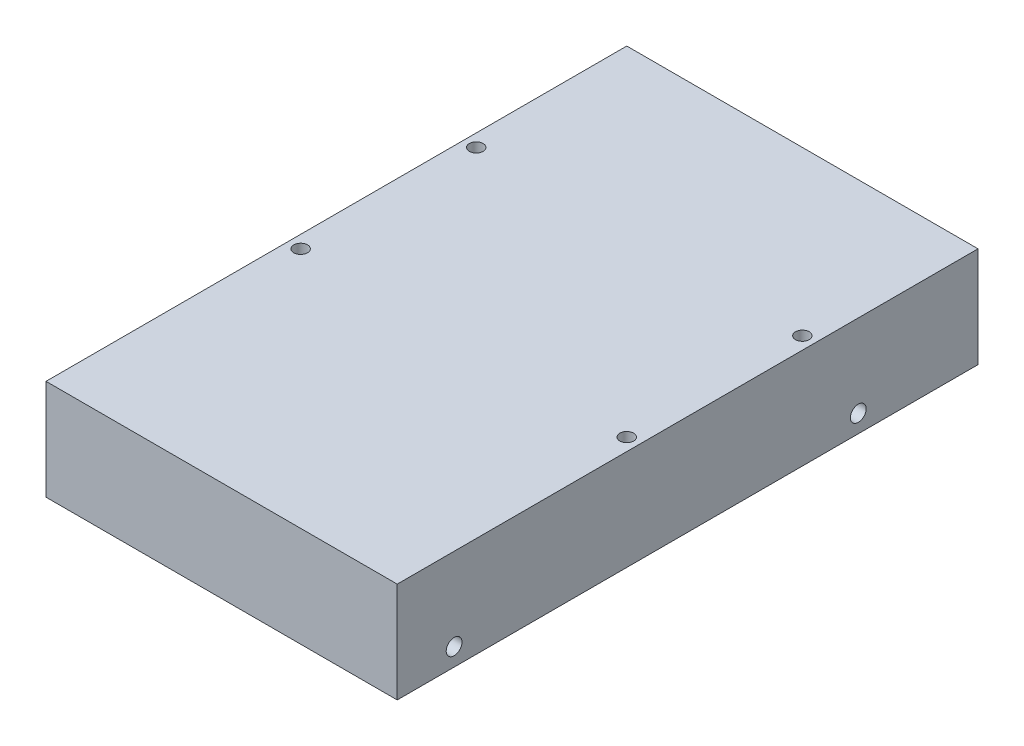
ISO-10303-21;
HEADER;
FILE_DESCRIPTION(('STEP AP214'),'2;1');
FILE_NAME('part.step','',(''),(''),'','','');
FILE_SCHEMA(('AUTOMOTIVE_DESIGN { 1 0 10303 214 1 1 1 1 }'));
ENDSEC;
DATA;
#1=APPLICATION_CONTEXT('core data for automotive mechanical design processes');
#2=APPLICATION_PROTOCOL_DEFINITION('international standard','automotive_design',2000,#1);
#3=PRODUCT_CONTEXT('',#1,'mechanical');
#4=PRODUCT('Part','Part','',(#3));
#5=PRODUCT_RELATED_PRODUCT_CATEGORY('part','',(#4));
#6=PRODUCT_DEFINITION_FORMATION('','',#4);
#7=PRODUCT_DEFINITION_CONTEXT('part definition',#1,'design');
#8=PRODUCT_DEFINITION('design','',#6,#7);
#9=PRODUCT_DEFINITION_SHAPE('','',#8);
#10=(LENGTH_UNIT() NAMED_UNIT(*) SI_UNIT(.MILLI.,.METRE.));
#11=(NAMED_UNIT(*) PLANE_ANGLE_UNIT() SI_UNIT($,.RADIAN.));
#12=(NAMED_UNIT(*) SI_UNIT($,.STERADIAN.) SOLID_ANGLE_UNIT());
#13=UNCERTAINTY_MEASURE_WITH_UNIT(LENGTH_MEASURE(1.E-05),#10,'distance_accuracy_value','');
#14=(GEOMETRIC_REPRESENTATION_CONTEXT(3) GLOBAL_UNCERTAINTY_ASSIGNED_CONTEXT((#13)) GLOBAL_UNIT_ASSIGNED_CONTEXT((#10,
#11,#12)) REPRESENTATION_CONTEXT('',''));
#15=CARTESIAN_POINT('',(0.,0.,0.));
#16=DIRECTION('',(0.,0.,1.));
#17=DIRECTION('',(1.,0.,0.));
#18=AXIS2_PLACEMENT_3D('',#15,#16,#17);
#19=CARTESIAN_POINT('',(44.45,25.4,73.5));
#20=DIRECTION('',(-1.,0.,0.));
#21=DIRECTION('',(0.,0.,1.));
#22=AXIS2_PLACEMENT_3D('',#19,#20,#21);
#23=PLANE('',#22);
#24=CARTESIAN_POINT('',(44.45,4.5,-43.2));
#25=DIRECTION('',(1.,0.,0.));
#26=DIRECTION('',(0.,0.,-1.));
#27=AXIS2_PLACEMENT_3D('',#24,#25,#26);
#28=CIRCLE('',#27,2.);
#29=CARTESIAN_POINT('',(44.45,4.5,-45.2));
#30=VERTEX_POINT('',#29);
#31=EDGE_CURVE('E141',#30,#30,#28,.T.);
#32=ORIENTED_EDGE('',*,*,#31,.F.);
#33=EDGE_LOOP('',(#32));
#34=FACE_BOUND('',#33,.T.);
#35=CARTESIAN_POINT('',(44.45,4.5,59.1));
#36=DIRECTION('',(1.,0.,0.));
#37=DIRECTION('',(0.,0.,-1.));
#38=AXIS2_PLACEMENT_3D('',#35,#36,#37);
#39=CIRCLE('',#38,2.);
#40=CARTESIAN_POINT('',(44.45,4.5,57.1));
#41=VERTEX_POINT('',#40);
#42=EDGE_CURVE('E135',#41,#41,#39,.T.);
#43=ORIENTED_EDGE('',*,*,#42,.F.);
#44=EDGE_LOOP('',(#43));
#45=FACE_BOUND('',#44,.T.);
#46=DIRECTION('',(0.,0.,-1.));
#47=VECTOR('',#46,1.);
#48=CARTESIAN_POINT('',(44.45,0.,73.5));
#49=LINE('',#48,#47);
#50=CARTESIAN_POINT('',(44.45,0.,73.5));
#51=VERTEX_POINT('',#50);
#52=CARTESIAN_POINT('',(44.45,0.,-73.5));
#53=VERTEX_POINT('',#52);
#54=EDGE_CURVE('E95',#51,#53,#49,.T.);
#55=ORIENTED_EDGE('',*,*,#54,.T.);
#56=DIRECTION('',(0.,-1.,0.));
#57=VECTOR('',#56,1.);
#58=CARTESIAN_POINT('',(44.45,25.4,-73.5));
#59=LINE('',#58,#57);
#60=CARTESIAN_POINT('',(44.45,25.4,-73.5));
#61=VERTEX_POINT('',#60);
#62=EDGE_CURVE('E11',#61,#53,#59,.T.);
#63=ORIENTED_EDGE('',*,*,#62,.F.);
#64=DIRECTION('',(0.,0.,-1.));
#65=VECTOR('',#64,1.);
#66=CARTESIAN_POINT('',(44.45,25.4,73.5));
#67=LINE('',#66,#65);
#68=CARTESIAN_POINT('',(44.45,25.4,73.5));
#69=VERTEX_POINT('',#68);
#70=EDGE_CURVE('E83',#69,#61,#67,.T.);
#71=ORIENTED_EDGE('',*,*,#70,.F.);
#72=DIRECTION('',(0.,-1.,0.));
#73=VECTOR('',#72,1.);
#74=CARTESIAN_POINT('',(44.45,25.4,73.5));
#75=LINE('',#74,#73);
#76=EDGE_CURVE('E91',#69,#51,#75,.T.);
#77=ORIENTED_EDGE('',*,*,#76,.T.);
#78=EDGE_LOOP('',(#55,#63,#71,#77));
#79=FACE_BOUND('',#78,.T.);
#80=ADVANCED_FACE('F32',(#34,#45,#79),#23,.F.);
#81=CARTESIAN_POINT('',(-44.45,25.4,-73.5));
#82=DIRECTION('',(0.,0.,1.));
#83=DIRECTION('',(1.,0.,0.));
#84=AXIS2_PLACEMENT_3D('',#81,#82,#83);
#85=PLANE('',#84);
#86=DIRECTION('',(-1.,0.,0.));
#87=VECTOR('',#86,1.);
#88=CARTESIAN_POINT('',(-44.45,0.,-73.5));
#89=LINE('',#88,#87);
#90=CARTESIAN_POINT('',(-44.45,0.,-73.5));
#91=VERTEX_POINT('',#90);
#92=EDGE_CURVE('E87',#53,#91,#89,.T.);
#93=ORIENTED_EDGE('',*,*,#92,.T.);
#94=DIRECTION('',(0.,-1.,0.));
#95=VECTOR('',#94,1.);
#96=CARTESIAN_POINT('',(-44.45,25.4,-73.5));
#97=LINE('',#96,#95);
#98=CARTESIAN_POINT('',(-44.45,25.4,-73.5));
#99=VERTEX_POINT('',#98);
#100=EDGE_CURVE('E40',#99,#91,#97,.T.);
#101=ORIENTED_EDGE('',*,*,#100,.F.);
#102=DIRECTION('',(-1.,0.,0.));
#103=VECTOR('',#102,1.);
#104=CARTESIAN_POINT('',(-44.45,25.4,-73.5));
#105=LINE('',#104,#103);
#106=EDGE_CURVE('E78',#61,#99,#105,.T.);
#107=ORIENTED_EDGE('',*,*,#106,.F.);
#108=ORIENTED_EDGE('',*,*,#62,.T.);
#109=EDGE_LOOP('',(#93,#101,#107,#108));
#110=FACE_BOUND('',#109,.T.);
#111=ADVANCED_FACE('F86',(#110),#85,.F.);
#112=CARTESIAN_POINT('',(-44.45,25.4,73.5));
#113=DIRECTION('',(1.,0.,0.));
#114=DIRECTION('',(0.,0.,-1.));
#115=AXIS2_PLACEMENT_3D('',#112,#113,#114);
#116=PLANE('',#115);
#117=CARTESIAN_POINT('',(-44.45,4.5,-43.2));
#118=DIRECTION('',(1.,0.,0.));
#119=DIRECTION('',(0.,0.,-1.));
#120=AXIS2_PLACEMENT_3D('',#117,#118,#119);
#121=CIRCLE('',#120,2.);
#122=CARTESIAN_POINT('',(-44.45,4.5,-45.2));
#123=VERTEX_POINT('',#122);
#124=EDGE_CURVE('E138',#123,#123,#121,.F.);
#125=ORIENTED_EDGE('',*,*,#124,.F.);
#126=EDGE_LOOP('',(#125));
#127=FACE_BOUND('',#126,.T.);
#128=CARTESIAN_POINT('',(-44.45,4.5,59.1));
#129=DIRECTION('',(1.,0.,0.));
#130=DIRECTION('',(0.,0.,-1.));
#131=AXIS2_PLACEMENT_3D('',#128,#129,#130);
#132=CIRCLE('',#131,2.);
#133=CARTESIAN_POINT('',(-44.45,4.5,57.1));
#134=VERTEX_POINT('',#133);
#135=EDGE_CURVE('E132',#134,#134,#132,.F.);
#136=ORIENTED_EDGE('',*,*,#135,.F.);
#137=EDGE_LOOP('',(#136));
#138=FACE_BOUND('',#137,.T.);
#139=DIRECTION('',(0.,0.,1.));
#140=VECTOR('',#139,1.);
#141=CARTESIAN_POINT('',(-44.45,0.,73.5));
#142=LINE('',#141,#140);
#143=CARTESIAN_POINT('',(-44.45,0.,73.5));
#144=VERTEX_POINT('',#143);
#145=EDGE_CURVE('E65',#91,#144,#142,.T.);
#146=ORIENTED_EDGE('',*,*,#145,.T.);
#147=DIRECTION('',(0.,-1.,0.));
#148=VECTOR('',#147,1.);
#149=CARTESIAN_POINT('',(-44.45,25.4,73.5));
#150=LINE('',#149,#148);
#151=CARTESIAN_POINT('',(-44.45,25.4,73.5));
#152=VERTEX_POINT('',#151);
#153=EDGE_CURVE('E88',#152,#144,#150,.T.);
#154=ORIENTED_EDGE('',*,*,#153,.F.);
#155=DIRECTION('',(0.,0.,1.));
#156=VECTOR('',#155,1.);
#157=CARTESIAN_POINT('',(-44.45,25.4,73.5));
#158=LINE('',#157,#156);
#159=EDGE_CURVE('E81',#99,#152,#158,.T.);
#160=ORIENTED_EDGE('',*,*,#159,.F.);
#161=ORIENTED_EDGE('',*,*,#100,.T.);
#162=EDGE_LOOP('',(#146,#154,#160,#161));
#163=FACE_BOUND('',#162,.T.);
#164=ADVANCED_FACE('F89',(#127,#138,#163),#116,.F.);
#165=CARTESIAN_POINT('',(-44.45,25.4,73.5));
#166=DIRECTION('',(0.,0.,-1.));
#167=DIRECTION('',(-1.,0.,0.));
#168=AXIS2_PLACEMENT_3D('',#165,#166,#167);
#169=PLANE('',#168);
#170=DIRECTION('',(1.,0.,0.));
#171=VECTOR('',#170,1.);
#172=CARTESIAN_POINT('',(-44.45,0.,73.5));
#173=LINE('',#172,#171);
#174=EDGE_CURVE('E71',#144,#51,#173,.T.);
#175=ORIENTED_EDGE('',*,*,#174,.T.);
#176=ORIENTED_EDGE('',*,*,#76,.F.);
#177=DIRECTION('',(1.,0.,0.));
#178=VECTOR('',#177,1.);
#179=CARTESIAN_POINT('',(-44.45,25.4,73.5));
#180=LINE('',#179,#178);
#181=EDGE_CURVE('E48',#152,#69,#180,.T.);
#182=ORIENTED_EDGE('',*,*,#181,.F.);
#183=ORIENTED_EDGE('',*,*,#153,.T.);
#184=EDGE_LOOP('',(#175,#176,#182,#183));
#185=FACE_BOUND('',#184,.T.);
#186=ADVANCED_FACE('F103',(#185),#169,.F.);
#187=CARTESIAN_POINT('',(0.,25.4,0.));
#188=DIRECTION('',(0.,-1.,0.));
#189=DIRECTION('',(0.,0.,-1.));
#190=AXIS2_PLACEMENT_3D('',#187,#188,#189);
#191=PLANE('',#190);
#192=CARTESIAN_POINT('',(-41.27,25.4,12.23));
#193=DIRECTION('',(0.,-1.,0.));
#194=DIRECTION('',(0.,0.,-1.));
#195=AXIS2_PLACEMENT_3D('',#192,#193,#194);
#196=CIRCLE('',#195,1.74244000000001);
#197=CARTESIAN_POINT('',(-41.27,25.4,10.48756));
#198=VERTEX_POINT('',#197);
#199=EDGE_CURVE('E126',#198,#198,#196,.T.);
#200=ORIENTED_EDGE('',*,*,#199,.T.);
#201=EDGE_LOOP('',(#200));
#202=FACE_BOUND('',#201,.T.);
#203=CARTESIAN_POINT('',(-41.27,25.4,-32.22));
#204=DIRECTION('',(0.,-1.,0.));
#205=DIRECTION('',(0.,0.,-1.));
#206=AXIS2_PLACEMENT_3D('',#203,#204,#205);
#207=CIRCLE('',#206,1.74244);
#208=CARTESIAN_POINT('',(-41.27,25.4,-33.96244));
#209=VERTEX_POINT('',#208);
#210=EDGE_CURVE('E120',#209,#209,#207,.T.);
#211=ORIENTED_EDGE('',*,*,#210,.T.);
#212=EDGE_LOOP('',(#211));
#213=FACE_BOUND('',#212,.T.);
#214=CARTESIAN_POINT('',(41.27,25.4,12.23));
#215=DIRECTION('',(0.,-1.,0.));
#216=DIRECTION('',(0.,0.,-1.));
#217=AXIS2_PLACEMENT_3D('',#214,#215,#216);
#218=CIRCLE('',#217,1.74244000000001);
#219=CARTESIAN_POINT('',(41.27,25.4,10.48756));
#220=VERTEX_POINT('',#219);
#221=EDGE_CURVE('E114',#220,#220,#218,.T.);
#222=ORIENTED_EDGE('',*,*,#221,.T.);
#223=EDGE_LOOP('',(#222));
#224=FACE_BOUND('',#223,.T.);
#225=CARTESIAN_POINT('',(41.27,25.4,-32.22));
#226=DIRECTION('',(0.,-1.,0.));
#227=DIRECTION('',(0.,0.,-1.));
#228=AXIS2_PLACEMENT_3D('',#225,#226,#227);
#229=CIRCLE('',#228,1.74244);
#230=CARTESIAN_POINT('',(41.27,25.4,-33.96244));
#231=VERTEX_POINT('',#230);
#232=EDGE_CURVE('E98',#231,#231,#229,.T.);
#233=ORIENTED_EDGE('',*,*,#232,.T.);
#234=EDGE_LOOP('',(#233));
#235=FACE_BOUND('',#234,.T.);
#236=ORIENTED_EDGE('',*,*,#70,.T.);
#237=ORIENTED_EDGE('',*,*,#106,.T.);
#238=ORIENTED_EDGE('',*,*,#159,.T.);
#239=ORIENTED_EDGE('',*,*,#181,.T.);
#240=EDGE_LOOP('',(#236,#237,#238,#239));
#241=FACE_BOUND('',#240,.T.);
#242=ADVANCED_FACE('F79',(#202,#213,#224,#235,#241),#191,.F.);
#243=CARTESIAN_POINT('',(0.,0.,0.));
#244=DIRECTION('',(0.,-1.,0.));
#245=DIRECTION('',(0.,0.,-1.));
#246=AXIS2_PLACEMENT_3D('',#243,#244,#245);
#247=PLANE('',#246);
#248=CARTESIAN_POINT('',(-41.27,0.,12.23));
#249=DIRECTION('',(0.,-1.,0.));
#250=DIRECTION('',(0.,0.,-1.));
#251=AXIS2_PLACEMENT_3D('',#248,#249,#250);
#252=CIRCLE('',#251,1.74244000000001);
#253=CARTESIAN_POINT('',(-41.27,0.,10.48756));
#254=VERTEX_POINT('',#253);
#255=EDGE_CURVE('E129',#254,#254,#252,.T.);
#256=ORIENTED_EDGE('',*,*,#255,.F.);
#257=EDGE_LOOP('',(#256));
#258=FACE_BOUND('',#257,.T.);
#259=CARTESIAN_POINT('',(-41.27,0.,-32.22));
#260=DIRECTION('',(0.,-1.,0.));
#261=DIRECTION('',(0.,0.,-1.));
#262=AXIS2_PLACEMENT_3D('',#259,#260,#261);
#263=CIRCLE('',#262,1.74244);
#264=CARTESIAN_POINT('',(-41.27,0.,-33.96244));
#265=VERTEX_POINT('',#264);
#266=EDGE_CURVE('E123',#265,#265,#263,.T.);
#267=ORIENTED_EDGE('',*,*,#266,.F.);
#268=EDGE_LOOP('',(#267));
#269=FACE_BOUND('',#268,.T.);
#270=CARTESIAN_POINT('',(41.27,0.,12.23));
#271=DIRECTION('',(0.,-1.,0.));
#272=DIRECTION('',(0.,0.,-1.));
#273=AXIS2_PLACEMENT_3D('',#270,#271,#272);
#274=CIRCLE('',#273,1.74244000000001);
#275=CARTESIAN_POINT('',(41.27,0.,10.48756));
#276=VERTEX_POINT('',#275);
#277=EDGE_CURVE('E117',#276,#276,#274,.T.);
#278=ORIENTED_EDGE('',*,*,#277,.F.);
#279=EDGE_LOOP('',(#278));
#280=FACE_BOUND('',#279,.T.);
#281=CARTESIAN_POINT('',(41.27,0.,-32.22));
#282=DIRECTION('',(0.,-1.,0.));
#283=DIRECTION('',(0.,0.,-1.));
#284=AXIS2_PLACEMENT_3D('',#281,#282,#283);
#285=CIRCLE('',#284,1.74244);
#286=CARTESIAN_POINT('',(41.27,0.,-33.96244));
#287=VERTEX_POINT('',#286);
#288=EDGE_CURVE('E111',#287,#287,#285,.T.);
#289=ORIENTED_EDGE('',*,*,#288,.F.);
#290=EDGE_LOOP('',(#289));
#291=FACE_BOUND('',#290,.T.);
#292=ORIENTED_EDGE('',*,*,#54,.F.);
#293=ORIENTED_EDGE('',*,*,#174,.F.);
#294=ORIENTED_EDGE('',*,*,#145,.F.);
#295=ORIENTED_EDGE('',*,*,#92,.F.);
#296=EDGE_LOOP('',(#292,#293,#294,#295));
#297=FACE_BOUND('',#296,.T.);
#298=ADVANCED_FACE('F106',(#258,#269,#280,#291,#297),#247,.T.);
#299=CARTESIAN_POINT('',(41.27,30.,-32.22));
#300=DIRECTION('',(0.,-1.,0.));
#301=DIRECTION('',(0.,0.,-1.));
#302=AXIS2_PLACEMENT_3D('',#299,#300,#301);
#303=CYLINDRICAL_SURFACE('',#302,1.74244);
#304=ORIENTED_EDGE('',*,*,#288,.T.);
#305=EDGE_LOOP('',(#304));
#306=FACE_BOUND('',#305,.T.);
#307=ORIENTED_EDGE('',*,*,#232,.F.);
#308=EDGE_LOOP('',(#307));
#309=FACE_BOUND('',#308,.T.);
#310=ADVANCED_FACE('F172',(#306,#309),#303,.F.);
#311=CARTESIAN_POINT('',(41.27,30.,12.23));
#312=DIRECTION('',(0.,-1.,0.));
#313=DIRECTION('',(0.,0.,-1.));
#314=AXIS2_PLACEMENT_3D('',#311,#312,#313);
#315=CYLINDRICAL_SURFACE('',#314,1.74244000000001);
#316=ORIENTED_EDGE('',*,*,#277,.T.);
#317=EDGE_LOOP('',(#316));
#318=FACE_BOUND('',#317,.T.);
#319=ORIENTED_EDGE('',*,*,#221,.F.);
#320=EDGE_LOOP('',(#319));
#321=FACE_BOUND('',#320,.T.);
#322=ADVANCED_FACE('F179',(#318,#321),#315,.F.);
#323=CARTESIAN_POINT('',(-41.27,30.,-32.22));
#324=DIRECTION('',(0.,-1.,0.));
#325=DIRECTION('',(0.,0.,-1.));
#326=AXIS2_PLACEMENT_3D('',#323,#324,#325);
#327=CYLINDRICAL_SURFACE('',#326,1.74244);
#328=ORIENTED_EDGE('',*,*,#266,.T.);
#329=EDGE_LOOP('',(#328));
#330=FACE_BOUND('',#329,.T.);
#331=ORIENTED_EDGE('',*,*,#210,.F.);
#332=EDGE_LOOP('',(#331));
#333=FACE_BOUND('',#332,.T.);
#334=ADVANCED_FACE('F183',(#330,#333),#327,.F.);
#335=CARTESIAN_POINT('',(-41.27,30.,12.23));
#336=DIRECTION('',(0.,-1.,0.));
#337=DIRECTION('',(0.,0.,-1.));
#338=AXIS2_PLACEMENT_3D('',#335,#336,#337);
#339=CYLINDRICAL_SURFACE('',#338,1.74244000000001);
#340=ORIENTED_EDGE('',*,*,#255,.T.);
#341=EDGE_LOOP('',(#340));
#342=FACE_BOUND('',#341,.T.);
#343=ORIENTED_EDGE('',*,*,#199,.F.);
#344=EDGE_LOOP('',(#343));
#345=FACE_BOUND('',#344,.T.);
#346=ADVANCED_FACE('F155',(#342,#345),#339,.F.);
#347=CARTESIAN_POINT('',(-44.451,4.5,59.1));
#348=DIRECTION('',(1.,0.,0.));
#349=DIRECTION('',(0.,0.,-1.));
#350=AXIS2_PLACEMENT_3D('',#347,#348,#349);
#351=CYLINDRICAL_SURFACE('',#350,2.);
#352=ORIENTED_EDGE('',*,*,#42,.T.);
#353=EDGE_LOOP('',(#352));
#354=FACE_BOUND('',#353,.T.);
#355=ORIENTED_EDGE('',*,*,#135,.T.);
#356=EDGE_LOOP('',(#355));
#357=FACE_BOUND('',#356,.T.);
#358=ADVANCED_FACE('F152',(#354,#357),#351,.F.);
#359=CARTESIAN_POINT('',(-44.451,4.5,-43.2));
#360=DIRECTION('',(1.,0.,0.));
#361=DIRECTION('',(0.,0.,-1.));
#362=AXIS2_PLACEMENT_3D('',#359,#360,#361);
#363=CYLINDRICAL_SURFACE('',#362,2.);
#364=ORIENTED_EDGE('',*,*,#31,.T.);
#365=EDGE_LOOP('',(#364));
#366=FACE_BOUND('',#365,.T.);
#367=ORIENTED_EDGE('',*,*,#124,.T.);
#368=EDGE_LOOP('',(#367));
#369=FACE_BOUND('',#368,.T.);
#370=ADVANCED_FACE('F145',(#366,#369),#363,.F.);
#371=CLOSED_SHELL('',(#80,#111,#164,#186,#242,#298,#310,#322,#334,#346,#358,#370));
#372=MANIFOLD_SOLID_BREP('B2',#371);
#373=ADVANCED_BREP_SHAPE_REPRESENTATION('',(#18,#372),#14);
#374=SHAPE_DEFINITION_REPRESENTATION(#9,#373);
ENDSEC;
END-ISO-10303-21;
